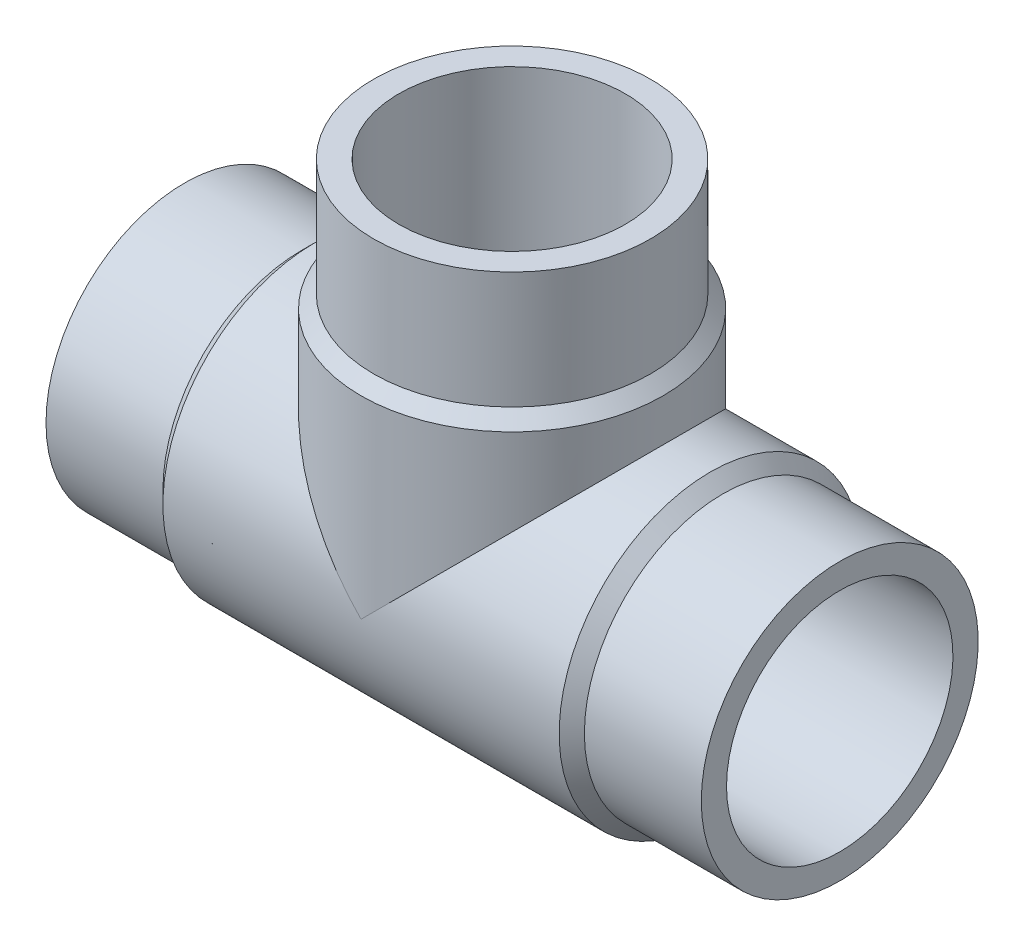
ISO-10303-21;
HEADER;
FILE_DESCRIPTION(('STEP AP214'),'2;1');
FILE_NAME('part.step','',(''),(''),'','','');
FILE_SCHEMA(('AUTOMOTIVE_DESIGN { 1 0 10303 214 1 1 1 1 }'));
ENDSEC;
DATA;
#1=APPLICATION_CONTEXT('core data for automotive mechanical design processes');
#2=APPLICATION_PROTOCOL_DEFINITION('international standard','automotive_design',2000,#1);
#3=PRODUCT_CONTEXT('',#1,'mechanical');
#4=PRODUCT('Part','Part','',(#3));
#5=PRODUCT_RELATED_PRODUCT_CATEGORY('part','',(#4));
#6=PRODUCT_DEFINITION_FORMATION('','',#4);
#7=PRODUCT_DEFINITION_CONTEXT('part definition',#1,'design');
#8=PRODUCT_DEFINITION('design','',#6,#7);
#9=PRODUCT_DEFINITION_SHAPE('','',#8);
#10=(LENGTH_UNIT() NAMED_UNIT(*) SI_UNIT(.MILLI.,.METRE.));
#11=(NAMED_UNIT(*) PLANE_ANGLE_UNIT() SI_UNIT($,.RADIAN.));
#12=(NAMED_UNIT(*) SI_UNIT($,.STERADIAN.) SOLID_ANGLE_UNIT());
#13=UNCERTAINTY_MEASURE_WITH_UNIT(LENGTH_MEASURE(1.E-05),#10,'distance_accuracy_value','');
#14=(GEOMETRIC_REPRESENTATION_CONTEXT(3) GLOBAL_UNCERTAINTY_ASSIGNED_CONTEXT((#13)) GLOBAL_UNIT_ASSIGNED_CONTEXT((#10,
#11,#12)) REPRESENTATION_CONTEXT('',''));
#15=CARTESIAN_POINT('',(0.,0.,0.));
#16=DIRECTION('',(0.,0.,1.));
#17=DIRECTION('',(1.,0.,0.));
#18=AXIS2_PLACEMENT_3D('',#15,#16,#17);
#19=CARTESIAN_POINT('',(-106.5,105.,0.));
#20=DIRECTION('',(0.,1.,0.));
#21=DIRECTION('',(0.,0.,1.));
#22=AXIS2_PLACEMENT_3D('',#19,#20,#21);
#23=CYLINDRICAL_SURFACE('',#22,45.);
#24=CARTESIAN_POINT('',(-106.5,105.,0.));
#25=DIRECTION('',(0.,1.,0.));
#26=DIRECTION('',(0.,0.,1.));
#27=AXIS2_PLACEMENT_3D('',#24,#25,#26);
#28=CIRCLE('',#27,45.);
#29=CARTESIAN_POINT('',(-106.5,105.,45.));
#30=VERTEX_POINT('',#29);
#31=EDGE_CURVE('E18',#30,#30,#28,.T.);
#32=ORIENTED_EDGE('',*,*,#31,.F.);
#33=EDGE_LOOP('',(#32));
#34=FACE_BOUND('',#33,.T.);
#35=CARTESIAN_POINT('',(-106.5,67.,0.));
#36=DIRECTION('',(0.,1.,0.));
#37=DIRECTION('',(1.,0.,0.));
#38=AXIS2_PLACEMENT_3D('',#35,#36,#37);
#39=CIRCLE('',#38,45.);
#40=CARTESIAN_POINT('',(-61.5,67.,0.));
#41=VERTEX_POINT('',#40);
#42=EDGE_CURVE('E71',#41,#41,#39,.F.);
#43=ORIENTED_EDGE('',*,*,#42,.F.);
#44=EDGE_LOOP('',(#43));
#45=FACE_BOUND('',#44,.T.);
#46=ADVANCED_FACE('F15',(#34,#45),#23,.T.);
#47=CARTESIAN_POINT('',(-106.5,67.,0.));
#48=DIRECTION('',(0.,-1.,0.));
#49=DIRECTION('',(0.,0.,-1.));
#50=AXIS2_PLACEMENT_3D('',#47,#48,#49);
#51=CONICAL_SURFACE('',#50,45.,0.785398163397438);
#52=CARTESIAN_POINT('',(-106.5,62.8999999999999,0.));
#53=DIRECTION('',(0.,1.,0.));
#54=DIRECTION('',(1.,0.,0.));
#55=AXIS2_PLACEMENT_3D('',#52,#53,#54);
#56=CIRCLE('',#55,49.1);
#57=CARTESIAN_POINT('',(-57.4,62.8999999999999,0.));
#58=VERTEX_POINT('',#57);
#59=EDGE_CURVE('E60',#58,#58,#56,.F.);
#60=ORIENTED_EDGE('',*,*,#59,.F.);
#61=EDGE_LOOP('',(#60));
#62=FACE_BOUND('',#61,.T.);
#63=ORIENTED_EDGE('',*,*,#42,.T.);
#64=EDGE_LOOP('',(#63));
#65=FACE_BOUND('',#64,.T.);
#66=ADVANCED_FACE('F141',(#62,#65),#51,.T.);
#67=CARTESIAN_POINT('',(-38.,0.,0.));
#68=DIRECTION('',(-1.,0.,0.));
#69=DIRECTION('',(0.,0.,1.));
#70=AXIS2_PLACEMENT_3D('',#67,#68,#69);
#71=CYLINDRICAL_SURFACE('',#70,45.);
#72=CARTESIAN_POINT('',(-38.,0.,0.));
#73=DIRECTION('',(1.,0.,0.));
#74=DIRECTION('',(0.,1.,0.));
#75=AXIS2_PLACEMENT_3D('',#72,#73,#74);
#76=CIRCLE('',#75,45.);
#77=CARTESIAN_POINT('',(-38.,45.,0.));
#78=VERTEX_POINT('',#77);
#79=EDGE_CURVE('E64',#78,#78,#76,.F.);
#80=ORIENTED_EDGE('',*,*,#79,.F.);
#81=EDGE_LOOP('',(#80));
#82=FACE_BOUND('',#81,.T.);
#83=CARTESIAN_POINT('',(0.,0.,0.));
#84=DIRECTION('',(-1.,0.,0.));
#85=DIRECTION('',(0.,0.,1.));
#86=AXIS2_PLACEMENT_3D('',#83,#84,#85);
#87=CIRCLE('',#86,45.);
#88=CARTESIAN_POINT('',(0.,0.,45.));
#89=VERTEX_POINT('',#88);
#90=EDGE_CURVE('E58',#89,#89,#87,.F.);
#91=ORIENTED_EDGE('',*,*,#90,.F.);
#92=EDGE_LOOP('',(#91));
#93=FACE_BOUND('',#92,.T.);
#94=ADVANCED_FACE('F136',(#82,#93),#71,.T.);
#95=CARTESIAN_POINT('',(-151.5,105.,45.5400021084174));
#96=DIRECTION('',(0.,1.,0.));
#97=DIRECTION('',(1.,0.,0.));
#98=AXIS2_PLACEMENT_3D('',#95,#96,#97);
#99=PLANE('',#98);
#100=CARTESIAN_POINT('',(-106.5,105.,0.));
#101=DIRECTION('',(0.,1.,0.));
#102=DIRECTION('',(0.,0.,1.));
#103=AXIS2_PLACEMENT_3D('',#100,#101,#102);
#104=CIRCLE('',#103,36.8);
#105=CARTESIAN_POINT('',(-106.5,105.,36.8));
#106=VERTEX_POINT('',#105);
#107=EDGE_CURVE('E52',#106,#106,#104,.T.);
#108=ORIENTED_EDGE('',*,*,#107,.F.);
#109=EDGE_LOOP('',(#108));
#110=FACE_BOUND('',#109,.T.);
#111=ORIENTED_EDGE('',*,*,#31,.T.);
#112=EDGE_LOOP('',(#111));
#113=FACE_BOUND('',#112,.T.);
#114=ADVANCED_FACE('F130',(#110,#113),#99,.T.);
#115=CARTESIAN_POINT('',(-38.,0.,0.));
#116=DIRECTION('',(-1.,0.,0.));
#117=DIRECTION('',(0.,0.,1.));
#118=AXIS2_PLACEMENT_3D('',#115,#116,#117);
#119=CONICAL_SURFACE('',#118,45.,0.785398163397439);
#120=ORIENTED_EDGE('',*,*,#79,.T.);
#121=EDGE_LOOP('',(#120));
#122=FACE_BOUND('',#121,.T.);
#123=CARTESIAN_POINT('',(-42.1000000000001,0.,0.));
#124=DIRECTION('',(-1.,0.,0.));
#125=DIRECTION('',(0.,1.,0.));
#126=AXIS2_PLACEMENT_3D('',#123,#124,#125);
#127=CIRCLE('',#126,49.1);
#128=CARTESIAN_POINT('',(-42.1000000000001,49.1,0.));
#129=VERTEX_POINT('',#128);
#130=EDGE_CURVE('E49',#129,#129,#127,.T.);
#131=ORIENTED_EDGE('',*,*,#130,.F.);
#132=EDGE_LOOP('',(#131));
#133=FACE_BOUND('',#132,.T.);
#134=ADVANCED_FACE('F95',(#122,#133),#119,.T.);
#135=CARTESIAN_POINT('',(-106.5,62.8999999999999,0.));
#136=DIRECTION('',(0.,1.,0.));
#137=DIRECTION('',(0.,0.,1.));
#138=AXIS2_PLACEMENT_3D('',#135,#136,#137);
#139=CYLINDRICAL_SURFACE('',#138,49.1);
#140=CARTESIAN_POINT('',(-106.5,0.,0.));
#141=DIRECTION('',(0.707106781186547,0.707106781186547,0.));
#142=DIRECTION('',(-0.707106781186547,0.707106781186547,0.));
#143=AXIS2_PLACEMENT_3D('',#140,#141,#142);
#144=ELLIPSE('',#143,69.437885912519,49.1);
#145=CARTESIAN_POINT('',(-106.5,0.,49.1));
#146=VERTEX_POINT('',#145);
#147=CARTESIAN_POINT('',(-106.5,0.,-49.1));
#148=VERTEX_POINT('',#147);
#149=EDGE_CURVE('E44',#146,#148,#144,.F.);
#150=ORIENTED_EDGE('',*,*,#149,.F.);
#151=CARTESIAN_POINT('',(-106.5,0.,0.));
#152=DIRECTION('',(-0.707106781186547,0.707106781186547,0.));
#153=DIRECTION('',(0.707106781186547,0.707106781186547,0.));
#154=AXIS2_PLACEMENT_3D('',#151,#152,#153);
#155=ELLIPSE('',#154,69.437885912519,49.1);
#156=EDGE_CURVE('E40',#148,#146,#155,.F.);
#157=ORIENTED_EDGE('',*,*,#156,.F.);
#158=EDGE_LOOP('',(#150,#157));
#159=FACE_BOUND('',#158,.T.);
#160=ORIENTED_EDGE('',*,*,#59,.T.);
#161=EDGE_LOOP('',(#160));
#162=FACE_BOUND('',#161,.T.);
#163=ADVANCED_FACE('F47',(#159,#162),#139,.T.);
#164=CARTESIAN_POINT('',(0.,45.,45.5400021084165));
#165=DIRECTION('',(1.,0.,0.));
#166=DIRECTION('',(0.,-1.,0.));
#167=AXIS2_PLACEMENT_3D('',#164,#165,#166);
#168=PLANE('',#167);
#169=CARTESIAN_POINT('',(0.,0.,0.));
#170=DIRECTION('',(-1.,0.,0.));
#171=DIRECTION('',(0.,0.,1.));
#172=AXIS2_PLACEMENT_3D('',#169,#170,#171);
#173=CIRCLE('',#172,36.8);
#174=CARTESIAN_POINT('',(0.,0.,36.8));
#175=VERTEX_POINT('',#174);
#176=EDGE_CURVE('E45',#175,#175,#173,.F.);
#177=ORIENTED_EDGE('',*,*,#176,.F.);
#178=EDGE_LOOP('',(#177));
#179=FACE_BOUND('',#178,.T.);
#180=ORIENTED_EDGE('',*,*,#90,.T.);
#181=EDGE_LOOP('',(#180));
#182=FACE_BOUND('',#181,.T.);
#183=ADVANCED_FACE('F85',(#179,#182),#168,.T.);
#184=CARTESIAN_POINT('',(-106.5,0.,0.));
#185=DIRECTION('',(0.,1.,0.));
#186=DIRECTION('',(0.,0.,1.));
#187=AXIS2_PLACEMENT_3D('',#184,#185,#186);
#188=CYLINDRICAL_SURFACE('',#187,36.8);
#189=CARTESIAN_POINT('',(-106.5,0.,0.));
#190=DIRECTION('',(-0.707106781186547,-0.707106781186548,0.));
#191=DIRECTION('',(-0.707106781186548,0.707106781186547,0.));
#192=AXIS2_PLACEMENT_3D('',#189,#190,#191);
#193=ELLIPSE('',#192,52.0430590953299,36.8);
#194=CARTESIAN_POINT('',(-106.5,0.,-36.8));
#195=VERTEX_POINT('',#194);
#196=CARTESIAN_POINT('',(-106.5,0.,36.8));
#197=VERTEX_POINT('',#196);
#198=EDGE_CURVE('E78',#195,#197,#193,.F.);
#199=ORIENTED_EDGE('',*,*,#198,.F.);
#200=CARTESIAN_POINT('',(-106.5,0.,0.));
#201=DIRECTION('',(-0.707106781186547,0.707106781186547,0.));
#202=DIRECTION('',(0.707106781186547,0.707106781186547,0.));
#203=AXIS2_PLACEMENT_3D('',#200,#201,#202);
#204=ELLIPSE('',#203,52.0430590953299,36.8);
#205=EDGE_CURVE('E32',#195,#197,#204,.F.);
#206=ORIENTED_EDGE('',*,*,#205,.T.);
#207=EDGE_LOOP('',(#199,#206));
#208=FACE_BOUND('',#207,.T.);
#209=ORIENTED_EDGE('',*,*,#107,.T.);
#210=EDGE_LOOP('',(#209));
#211=FACE_BOUND('',#210,.T.);
#212=ADVANCED_FACE('F87',(#208,#211),#188,.F.);
#213=CARTESIAN_POINT('',(-170.9,0.,0.));
#214=DIRECTION('',(-1.,0.,0.));
#215=DIRECTION('',(0.,0.,1.));
#216=AXIS2_PLACEMENT_3D('',#213,#214,#215);
#217=CYLINDRICAL_SURFACE('',#216,49.1);
#218=ORIENTED_EDGE('',*,*,#130,.T.);
#219=EDGE_LOOP('',(#218));
#220=FACE_BOUND('',#219,.T.);
#221=CARTESIAN_POINT('',(-170.9,0.,0.));
#222=DIRECTION('',(-1.,0.,0.));
#223=DIRECTION('',(0.,1.,0.));
#224=AXIS2_PLACEMENT_3D('',#221,#222,#223);
#225=CIRCLE('',#224,49.1);
#226=CARTESIAN_POINT('',(-170.9,49.1,0.));
#227=VERTEX_POINT('',#226);
#228=EDGE_CURVE('E77',#227,#227,#225,.T.);
#229=ORIENTED_EDGE('',*,*,#228,.F.);
#230=EDGE_LOOP('',(#229));
#231=FACE_BOUND('',#230,.T.);
#232=ORIENTED_EDGE('',*,*,#149,.T.);
#233=ORIENTED_EDGE('',*,*,#156,.T.);
#234=EDGE_LOOP('',(#232,#233));
#235=FACE_BOUND('',#234,.T.);
#236=ADVANCED_FACE('F43',(#220,#231,#235),#217,.T.);
#237=CARTESIAN_POINT('',(-106.5,0.,0.));
#238=DIRECTION('',(-1.,0.,0.));
#239=DIRECTION('',(0.,-1.,0.));
#240=AXIS2_PLACEMENT_3D('',#237,#238,#239);
#241=CYLINDRICAL_SURFACE('',#240,36.8);
#242=ORIENTED_EDGE('',*,*,#205,.F.);
#243=ORIENTED_EDGE('',*,*,#198,.T.);
#244=EDGE_LOOP('',(#242,#243));
#245=FACE_BOUND('',#244,.T.);
#246=ORIENTED_EDGE('',*,*,#176,.T.);
#247=EDGE_LOOP('',(#246));
#248=FACE_BOUND('',#247,.T.);
#249=CARTESIAN_POINT('',(-213.,0.,0.));
#250=DIRECTION('',(-1.,0.,0.));
#251=DIRECTION('',(0.,-1.,0.));
#252=AXIS2_PLACEMENT_3D('',#249,#250,#251);
#253=CIRCLE('',#252,36.8);
#254=CARTESIAN_POINT('',(-213.,-36.8,0.));
#255=VERTEX_POINT('',#254);
#256=EDGE_CURVE('E74',#255,#255,#253,.F.);
#257=ORIENTED_EDGE('',*,*,#256,.F.);
#258=EDGE_LOOP('',(#257));
#259=FACE_BOUND('',#258,.T.);
#260=ADVANCED_FACE('F82',(#245,#248,#259),#241,.F.);
#261=CARTESIAN_POINT('',(-175.,0.,0.));
#262=DIRECTION('',(1.,0.,0.));
#263=DIRECTION('',(0.,0.,-1.));
#264=AXIS2_PLACEMENT_3D('',#261,#262,#263);
#265=CONICAL_SURFACE('',#264,45.,0.78539816339744);
#266=ORIENTED_EDGE('',*,*,#228,.T.);
#267=EDGE_LOOP('',(#266));
#268=FACE_BOUND('',#267,.T.);
#269=CARTESIAN_POINT('',(-175.,0.,0.));
#270=DIRECTION('',(-1.,0.,0.));
#271=DIRECTION('',(0.,1.,0.));
#272=AXIS2_PLACEMENT_3D('',#269,#270,#271);
#273=CIRCLE('',#272,45.);
#274=CARTESIAN_POINT('',(-175.,45.,0.));
#275=VERTEX_POINT('',#274);
#276=EDGE_CURVE('E24',#275,#275,#273,.T.);
#277=ORIENTED_EDGE('',*,*,#276,.F.);
#278=EDGE_LOOP('',(#277));
#279=FACE_BOUND('',#278,.T.);
#280=ADVANCED_FACE('F105',(#268,#279),#265,.T.);
#281=CARTESIAN_POINT('',(-213.,-45.,45.5400021084174));
#282=DIRECTION('',(-1.,0.,0.));
#283=DIRECTION('',(0.,1.,0.));
#284=AXIS2_PLACEMENT_3D('',#281,#282,#283);
#285=PLANE('',#284);
#286=ORIENTED_EDGE('',*,*,#256,.T.);
#287=EDGE_LOOP('',(#286));
#288=FACE_BOUND('',#287,.T.);
#289=CARTESIAN_POINT('',(-213.,0.,0.));
#290=DIRECTION('',(-1.,0.,0.));
#291=DIRECTION('',(0.,0.,1.));
#292=AXIS2_PLACEMENT_3D('',#289,#290,#291);
#293=CIRCLE('',#292,45.);
#294=CARTESIAN_POINT('',(-213.,0.,45.));
#295=VERTEX_POINT('',#294);
#296=EDGE_CURVE('E9',#295,#295,#293,.F.);
#297=ORIENTED_EDGE('',*,*,#296,.F.);
#298=EDGE_LOOP('',(#297));
#299=FACE_BOUND('',#298,.T.);
#300=ADVANCED_FACE('F99',(#288,#299),#285,.T.);
#301=CARTESIAN_POINT('',(-213.,0.,0.));
#302=DIRECTION('',(-1.,0.,0.));
#303=DIRECTION('',(0.,0.,1.));
#304=AXIS2_PLACEMENT_3D('',#301,#302,#303);
#305=CYLINDRICAL_SURFACE('',#304,45.);
#306=ORIENTED_EDGE('',*,*,#276,.T.);
#307=EDGE_LOOP('',(#306));
#308=FACE_BOUND('',#307,.T.);
#309=ORIENTED_EDGE('',*,*,#296,.T.);
#310=EDGE_LOOP('',(#309));
#311=FACE_BOUND('',#310,.T.);
#312=ADVANCED_FACE('F97',(#308,#311),#305,.T.);
#313=CLOSED_SHELL('',(#46,#66,#94,#114,#134,#163,#183,#212,#236,#260,#280,#300,#312));
#314=MANIFOLD_SOLID_BREP('B1',#313);
#315=ADVANCED_BREP_SHAPE_REPRESENTATION('',(#18,#314),#14);
#316=SHAPE_DEFINITION_REPRESENTATION(#9,#315);
ENDSEC;
END-ISO-10303-21;
